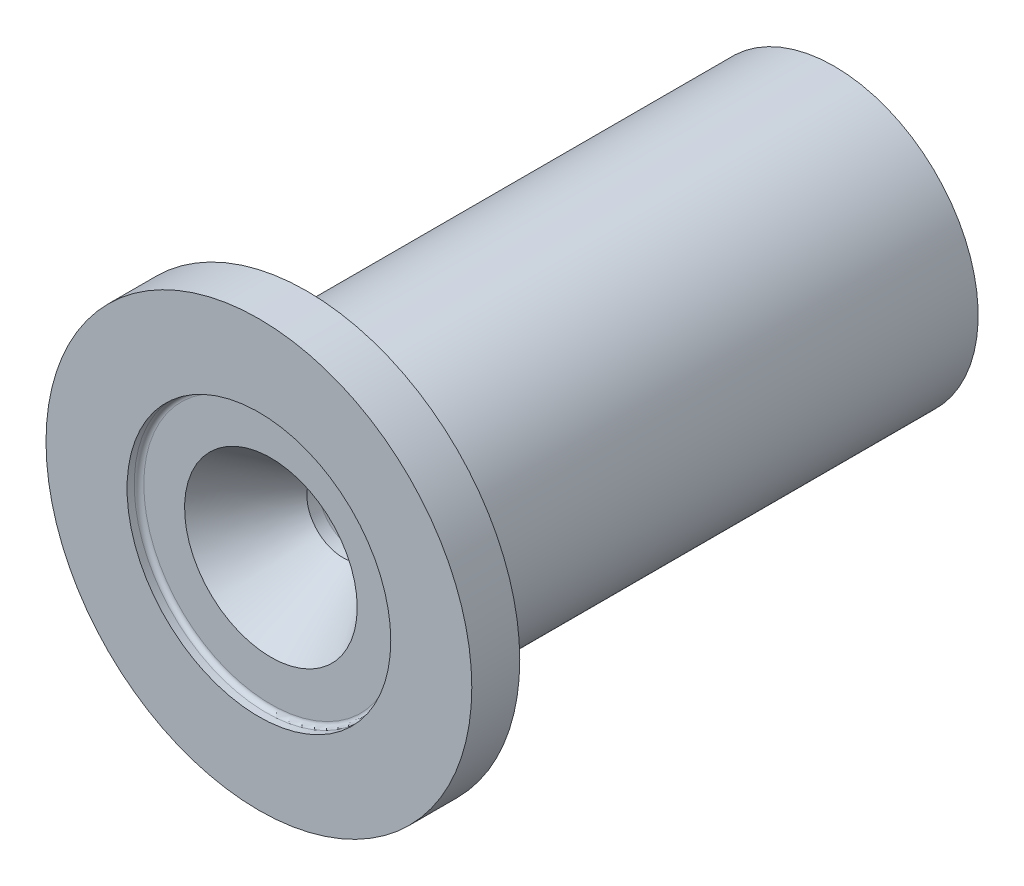
ISO-10303-21;
HEADER;
FILE_DESCRIPTION(('STEP AP214'),'2;1');
FILE_NAME('part.step','',(''),(''),'','','');
FILE_SCHEMA(('AUTOMOTIVE_DESIGN { 1 0 10303 214 1 1 1 1 }'));
ENDSEC;
DATA;
#1=APPLICATION_CONTEXT('core data for automotive mechanical design processes');
#2=APPLICATION_PROTOCOL_DEFINITION('international standard','automotive_design',2000,#1);
#3=PRODUCT_CONTEXT('',#1,'mechanical');
#4=PRODUCT('Part','Part','',(#3));
#5=PRODUCT_RELATED_PRODUCT_CATEGORY('part','',(#4));
#6=PRODUCT_DEFINITION_FORMATION('','',#4);
#7=PRODUCT_DEFINITION_CONTEXT('part definition',#1,'design');
#8=PRODUCT_DEFINITION('design','',#6,#7);
#9=PRODUCT_DEFINITION_SHAPE('','',#8);
#10=(LENGTH_UNIT() NAMED_UNIT(*) SI_UNIT(.MILLI.,.METRE.));
#11=(NAMED_UNIT(*) PLANE_ANGLE_UNIT() SI_UNIT($,.RADIAN.));
#12=(NAMED_UNIT(*) SI_UNIT($,.STERADIAN.) SOLID_ANGLE_UNIT());
#13=UNCERTAINTY_MEASURE_WITH_UNIT(LENGTH_MEASURE(1.E-05),#10,'distance_accuracy_value','');
#14=(GEOMETRIC_REPRESENTATION_CONTEXT(3) GLOBAL_UNCERTAINTY_ASSIGNED_CONTEXT((#13)) GLOBAL_UNIT_ASSIGNED_CONTEXT((#10,
#11,#12)) REPRESENTATION_CONTEXT('',''));
#15=CARTESIAN_POINT('',(0.,0.,0.));
#16=DIRECTION('',(0.,0.,1.));
#17=DIRECTION('',(1.,0.,0.));
#18=AXIS2_PLACEMENT_3D('',#15,#16,#17);
#19=CARTESIAN_POINT('',(0.,0.,76.2));
#20=DIRECTION('',(0.,0.,1.));
#21=DIRECTION('',(0.,-1.,0.));
#22=AXIS2_PLACEMENT_3D('',#19,#20,#21);
#23=CONICAL_SURFACE('',#22,25.0871125367109,0.610865238198018);
#24=CARTESIAN_POINT('',(0.,0.,53.975));
#25=DIRECTION('',(0.,0.,1.));
#26=DIRECTION('',(0.,-1.,0.));
#27=AXIS2_PLACEMENT_3D('',#24,#25,#26);
#28=CIRCLE('',#27,9.525);
#29=CARTESIAN_POINT('',(0.,-9.52500000000001,53.975));
#30=VERTEX_POINT('',#29);
#31=EDGE_CURVE('E56',#30,#30,#28,.T.);
#32=ORIENTED_EDGE('',*,*,#31,.F.);
#33=EDGE_LOOP('',(#32));
#34=FACE_BOUND('',#33,.T.);
#35=CARTESIAN_POINT('',(0.,0.,73.025));
#36=DIRECTION('',(0.,0.,1.));
#37=DIRECTION('',(1.,0.,0.));
#38=AXIS2_PLACEMENT_3D('',#35,#36,#37);
#39=CIRCLE('',#38,22.863953602895);
#40=CARTESIAN_POINT('',(22.863953602895,0.,73.025));
#41=VERTEX_POINT('',#40);
#42=EDGE_CURVE('E49',#41,#41,#39,.F.);
#43=ORIENTED_EDGE('',*,*,#42,.F.);
#44=EDGE_LOOP('',(#43));
#45=FACE_BOUND('',#44,.T.);
#46=ADVANCED_FACE('F31',(#34,#45),#23,.F.);
#47=CARTESIAN_POINT('',(0.,56.388,76.2));
#48=DIRECTION('',(0.,0.,-1.));
#49=DIRECTION('',(0.,1.,0.));
#50=AXIS2_PLACEMENT_3D('',#47,#48,#49);
#51=PLANE('',#50);
#52=CARTESIAN_POINT('',(0.,0.,76.2));
#53=DIRECTION('',(0.,0.,1.));
#54=DIRECTION('',(1.,0.,0.));
#55=AXIS2_PLACEMENT_3D('',#52,#53,#54);
#56=CIRCLE('',#55,34.925);
#57=CARTESIAN_POINT('',(34.925,0.,76.2));
#58=VERTEX_POINT('',#57);
#59=EDGE_CURVE('E52',#58,#58,#56,.T.);
#60=ORIENTED_EDGE('',*,*,#59,.F.);
#61=EDGE_LOOP('',(#60));
#62=FACE_BOUND('',#61,.T.);
#63=CARTESIAN_POINT('',(0.,0.,76.2));
#64=DIRECTION('',(0.,0.,1.));
#65=DIRECTION('',(0.,-1.,0.));
#66=AXIS2_PLACEMENT_3D('',#63,#64,#65);
#67=CIRCLE('',#66,56.388);
#68=CARTESIAN_POINT('',(0.,-56.388,76.2));
#69=VERTEX_POINT('',#68);
#70=EDGE_CURVE('E51',#69,#69,#67,.T.);
#71=ORIENTED_EDGE('',*,*,#70,.T.);
#72=EDGE_LOOP('',(#71));
#73=FACE_BOUND('',#72,.T.);
#74=ADVANCED_FACE('F78',(#62,#73),#51,.F.);
#75=CARTESIAN_POINT('',(0.,0.,76.1999999999999));
#76=DIRECTION('',(0.,0.,1.));
#77=DIRECTION('',(0.,-1.,0.));
#78=AXIS2_PLACEMENT_3D('',#75,#76,#77);
#79=CYLINDRICAL_SURFACE('',#78,9.525);
#80=CARTESIAN_POINT('',(0.,0.,50.8));
#81=DIRECTION('',(0.,0.,1.));
#82=DIRECTION('',(0.,-1.,0.));
#83=AXIS2_PLACEMENT_3D('',#80,#81,#82);
#84=CIRCLE('',#83,9.525);
#85=CARTESIAN_POINT('',(0.,-9.525,50.8));
#86=VERTEX_POINT('',#85);
#87=EDGE_CURVE('E59',#86,#86,#84,.T.);
#88=ORIENTED_EDGE('',*,*,#87,.F.);
#89=EDGE_LOOP('',(#88));
#90=FACE_BOUND('',#89,.T.);
#91=ORIENTED_EDGE('',*,*,#31,.T.);
#92=EDGE_LOOP('',(#91));
#93=FACE_BOUND('',#92,.T.);
#94=ADVANCED_FACE('F81',(#90,#93),#79,.F.);
#95=CARTESIAN_POINT('',(0.,0.,50.8));
#96=DIRECTION('',(0.,0.,-1.));
#97=DIRECTION('',(0.,1.,0.));
#98=AXIS2_PLACEMENT_3D('',#95,#96,#97);
#99=CONICAL_SURFACE('',#98,9.525,0.174532925199434);
#100=CARTESIAN_POINT('',(0.,0.,-76.1999999999999));
#101=DIRECTION('',(0.,0.,1.));
#102=DIRECTION('',(0.,-1.,0.));
#103=AXIS2_PLACEMENT_3D('',#100,#101,#102);
#104=CIRCLE('',#103,31.9185265499752);
#105=CARTESIAN_POINT('',(0.,-31.9185265499751,-76.2));
#106=VERTEX_POINT('',#105);
#107=EDGE_CURVE('E62',#106,#106,#104,.T.);
#108=ORIENTED_EDGE('',*,*,#107,.F.);
#109=EDGE_LOOP('',(#108));
#110=FACE_BOUND('',#109,.T.);
#111=ORIENTED_EDGE('',*,*,#87,.T.);
#112=EDGE_LOOP('',(#111));
#113=FACE_BOUND('',#112,.T.);
#114=ADVANCED_FACE('F127',(#110,#113),#99,.F.);
#115=CARTESIAN_POINT('',(0.,31.9185265499752,-76.2));
#116=DIRECTION('',(0.,0.,1.));
#117=DIRECTION('',(0.,-1.,0.));
#118=AXIS2_PLACEMENT_3D('',#115,#116,#117);
#119=PLANE('',#118);
#120=CARTESIAN_POINT('',(0.,0.,-76.2));
#121=DIRECTION('',(0.,0.,1.));
#122=DIRECTION('',(0.,-1.,0.));
#123=AXIS2_PLACEMENT_3D('',#120,#121,#122);
#124=CIRCLE('',#123,38.1);
#125=CARTESIAN_POINT('',(0.,-38.0999999999999,-76.2));
#126=VERTEX_POINT('',#125);
#127=EDGE_CURVE('E65',#126,#126,#124,.T.);
#128=ORIENTED_EDGE('',*,*,#127,.F.);
#129=EDGE_LOOP('',(#128));
#130=FACE_BOUND('',#129,.T.);
#131=ORIENTED_EDGE('',*,*,#107,.T.);
#132=EDGE_LOOP('',(#131));
#133=FACE_BOUND('',#132,.T.);
#134=ADVANCED_FACE('F100',(#130,#133),#119,.F.);
#135=CARTESIAN_POINT('',(0.,0.,76.1999999999999));
#136=DIRECTION('',(0.,0.,1.));
#137=DIRECTION('',(0.,-1.,0.));
#138=AXIS2_PLACEMENT_3D('',#135,#136,#137);
#139=CYLINDRICAL_SURFACE('',#138,38.1);
#140=CARTESIAN_POINT('',(0.,0.,57.15));
#141=DIRECTION('',(0.,0.,1.));
#142=DIRECTION('',(0.,-1.,0.));
#143=AXIS2_PLACEMENT_3D('',#140,#141,#142);
#144=CIRCLE('',#143,38.1);
#145=CARTESIAN_POINT('',(0.,-38.1,57.15));
#146=VERTEX_POINT('',#145);
#147=EDGE_CURVE('E42',#146,#146,#144,.F.);
#148=ORIENTED_EDGE('',*,*,#147,.T.);
#149=EDGE_LOOP('',(#148));
#150=FACE_BOUND('',#149,.T.);
#151=ORIENTED_EDGE('',*,*,#127,.T.);
#152=EDGE_LOOP('',(#151));
#153=FACE_BOUND('',#152,.T.);
#154=ADVANCED_FACE('F94',(#150,#153),#139,.T.);
#155=CARTESIAN_POINT('',(0.,38.1,63.5));
#156=DIRECTION('',(0.,0.,1.));
#157=DIRECTION('',(0.,-1.,0.));
#158=AXIS2_PLACEMENT_3D('',#155,#156,#157);
#159=PLANE('',#158);
#160=CARTESIAN_POINT('',(0.,0.,63.5));
#161=DIRECTION('',(0.,0.,1.));
#162=DIRECTION('',(0.,-1.,0.));
#163=AXIS2_PLACEMENT_3D('',#160,#161,#162);
#164=CIRCLE('',#163,44.45);
#165=CARTESIAN_POINT('',(0.,-44.45,63.5));
#166=VERTEX_POINT('',#165);
#167=EDGE_CURVE('E46',#166,#166,#164,.T.);
#168=ORIENTED_EDGE('',*,*,#167,.T.);
#169=EDGE_LOOP('',(#168));
#170=FACE_BOUND('',#169,.T.);
#171=CARTESIAN_POINT('',(0.,0.,63.5));
#172=DIRECTION('',(0.,0.,1.));
#173=DIRECTION('',(0.,-1.,0.));
#174=AXIS2_PLACEMENT_3D('',#171,#172,#173);
#175=CIRCLE('',#174,56.388);
#176=CARTESIAN_POINT('',(0.,-56.388,63.5));
#177=VERTEX_POINT('',#176);
#178=EDGE_CURVE('E68',#177,#177,#175,.T.);
#179=ORIENTED_EDGE('',*,*,#178,.F.);
#180=EDGE_LOOP('',(#179));
#181=FACE_BOUND('',#180,.T.);
#182=ADVANCED_FACE('F89',(#170,#181),#159,.F.);
#183=CARTESIAN_POINT('',(0.,0.,76.1999999999999));
#184=DIRECTION('',(0.,0.,1.));
#185=DIRECTION('',(0.,-1.,0.));
#186=AXIS2_PLACEMENT_3D('',#183,#184,#185);
#187=CYLINDRICAL_SURFACE('',#186,56.388);
#188=ORIENTED_EDGE('',*,*,#70,.F.);
#189=EDGE_LOOP('',(#188));
#190=FACE_BOUND('',#189,.T.);
#191=ORIENTED_EDGE('',*,*,#178,.T.);
#192=EDGE_LOOP('',(#191));
#193=FACE_BOUND('',#192,.T.);
#194=ADVANCED_FACE('F85',(#190,#193),#187,.T.);
#195=CARTESIAN_POINT('',(0.,0.,57.15));
#196=DIRECTION('',(0.,0.,1.));
#197=DIRECTION('',(0.,-1.,0.));
#198=AXIS2_PLACEMENT_3D('',#195,#196,#197);
#199=TOROIDAL_SURFACE('',#198,44.45,6.35);
#200=ORIENTED_EDGE('',*,*,#147,.F.);
#201=EDGE_LOOP('',(#200));
#202=FACE_BOUND('',#201,.T.);
#203=ORIENTED_EDGE('',*,*,#167,.F.);
#204=EDGE_LOOP('',(#203));
#205=FACE_BOUND('',#204,.T.);
#206=ADVANCED_FACE('F88',(#202,#205),#199,.F.);
#207=CARTESIAN_POINT('',(0.,0.,73.025));
#208=DIRECTION('',(0.,0.,1.));
#209=DIRECTION('',(1.,0.,0.));
#210=AXIS2_PLACEMENT_3D('',#207,#208,#209);
#211=PLANE('',#210);
#212=CARTESIAN_POINT('',(0.,0.,73.025));
#213=DIRECTION('',(0.,0.,1.));
#214=DIRECTION('',(1.,0.,0.));
#215=AXIS2_PLACEMENT_3D('',#212,#213,#214);
#216=CIRCLE('',#215,33.655);
#217=CARTESIAN_POINT('',(33.655,0.,73.025));
#218=VERTEX_POINT('',#217);
#219=EDGE_CURVE('E38',#218,#218,#216,.T.);
#220=ORIENTED_EDGE('',*,*,#219,.T.);
#221=EDGE_LOOP('',(#220));
#222=FACE_BOUND('',#221,.T.);
#223=ORIENTED_EDGE('',*,*,#42,.T.);
#224=EDGE_LOOP('',(#223));
#225=FACE_BOUND('',#224,.T.);
#226=ADVANCED_FACE('F113',(#222,#225),#211,.T.);
#227=CARTESIAN_POINT('',(0.,0.,73.025));
#228=DIRECTION('',(0.,0.,1.));
#229=DIRECTION('',(1.,0.,0.));
#230=AXIS2_PLACEMENT_3D('',#227,#228,#229);
#231=CYLINDRICAL_SURFACE('',#230,34.925);
#232=CARTESIAN_POINT('',(0.,0.,74.295));
#233=DIRECTION('',(0.,0.,1.));
#234=DIRECTION('',(1.,0.,0.));
#235=AXIS2_PLACEMENT_3D('',#232,#233,#234);
#236=CIRCLE('',#235,34.925);
#237=CARTESIAN_POINT('',(34.925,0.,74.295));
#238=VERTEX_POINT('',#237);
#239=EDGE_CURVE('E10',#238,#238,#236,.F.);
#240=ORIENTED_EDGE('',*,*,#239,.T.);
#241=EDGE_LOOP('',(#240));
#242=FACE_BOUND('',#241,.T.);
#243=ORIENTED_EDGE('',*,*,#59,.T.);
#244=EDGE_LOOP('',(#243));
#245=FACE_BOUND('',#244,.T.);
#246=ADVANCED_FACE('F76',(#242,#245),#231,.F.);
#247=CARTESIAN_POINT('',(0.,0.,74.295));
#248=DIRECTION('',(0.,0.,1.));
#249=DIRECTION('',(1.,0.,0.));
#250=AXIS2_PLACEMENT_3D('',#247,#248,#249);
#251=TOROIDAL_SURFACE('',#250,33.655,1.27);
#252=ORIENTED_EDGE('',*,*,#239,.F.);
#253=EDGE_LOOP('',(#252));
#254=FACE_BOUND('',#253,.T.);
#255=ORIENTED_EDGE('',*,*,#219,.F.);
#256=EDGE_LOOP('',(#255));
#257=FACE_BOUND('',#256,.T.);
#258=ADVANCED_FACE('F33',(#254,#257),#251,.F.);
#259=CLOSED_SHELL('',(#46,#74,#94,#114,#134,#154,#182,#194,#206,#226,#246,#258));
#260=MANIFOLD_SOLID_BREP('B2',#259);
#261=ADVANCED_BREP_SHAPE_REPRESENTATION('',(#18,#260),#14);
#262=SHAPE_DEFINITION_REPRESENTATION(#9,#261);
ENDSEC;
END-ISO-10303-21;
